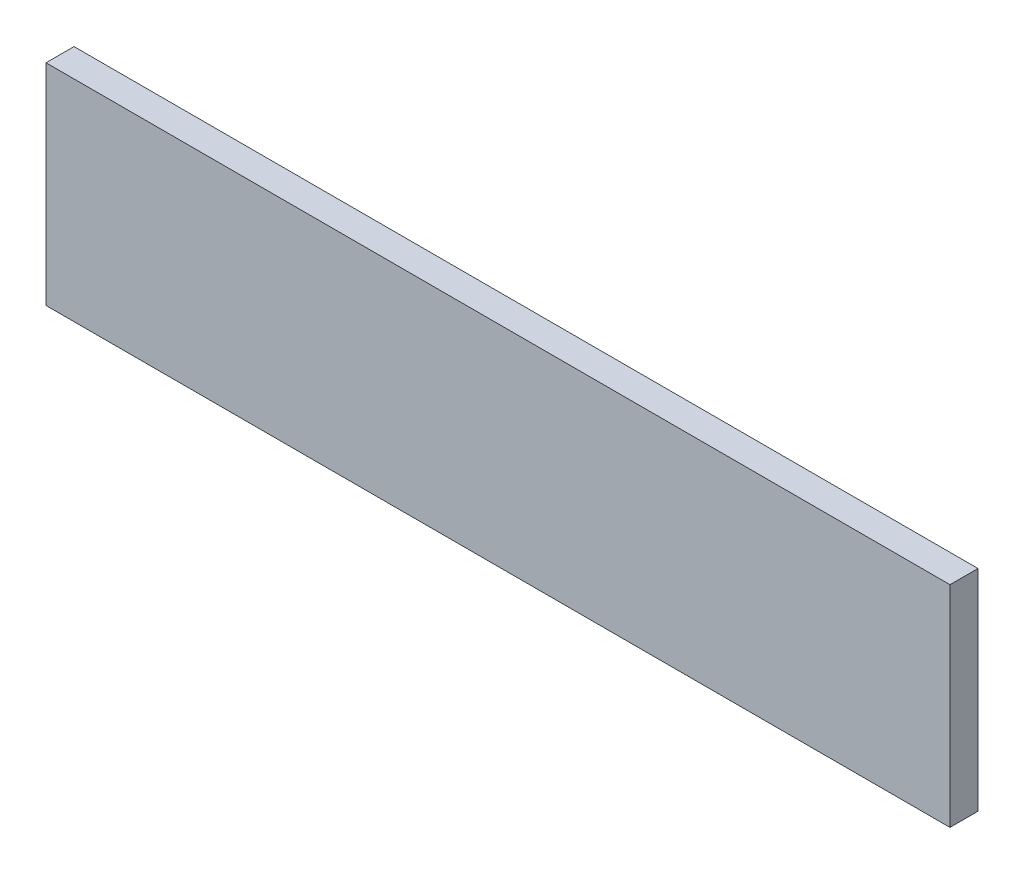
ISO-10303-21;
HEADER;
FILE_DESCRIPTION(('STEP AP214'),'2;1');
FILE_NAME('part.step','',(''),(''),'','','');
FILE_SCHEMA(('AUTOMOTIVE_DESIGN { 1 0 10303 214 1 1 1 1 }'));
ENDSEC;
DATA;
#1=APPLICATION_CONTEXT('core data for automotive mechanical design processes');
#2=APPLICATION_PROTOCOL_DEFINITION('international standard','automotive_design',2000,#1);
#3=PRODUCT_CONTEXT('',#1,'mechanical');
#4=PRODUCT('Part','Part','',(#3));
#5=PRODUCT_RELATED_PRODUCT_CATEGORY('part','',(#4));
#6=PRODUCT_DEFINITION_FORMATION('','',#4);
#7=PRODUCT_DEFINITION_CONTEXT('part definition',#1,'design');
#8=PRODUCT_DEFINITION('design','',#6,#7);
#9=PRODUCT_DEFINITION_SHAPE('','',#8);
#10=(LENGTH_UNIT() NAMED_UNIT(*) SI_UNIT(.MILLI.,.METRE.));
#11=(NAMED_UNIT(*) PLANE_ANGLE_UNIT() SI_UNIT($,.RADIAN.));
#12=(NAMED_UNIT(*) SI_UNIT($,.STERADIAN.) SOLID_ANGLE_UNIT());
#13=UNCERTAINTY_MEASURE_WITH_UNIT(LENGTH_MEASURE(1.E-05),#10,'distance_accuracy_value','');
#14=(GEOMETRIC_REPRESENTATION_CONTEXT(3) GLOBAL_UNCERTAINTY_ASSIGNED_CONTEXT((#13)) GLOBAL_UNIT_ASSIGNED_CONTEXT((#10,
#11,#12)) REPRESENTATION_CONTEXT('',''));
#15=CARTESIAN_POINT('',(0.,0.,0.));
#16=DIRECTION('',(0.,0.,1.));
#17=DIRECTION('',(1.,0.,0.));
#18=AXIS2_PLACEMENT_3D('',#15,#16,#17);
#19=CARTESIAN_POINT('',(-417.396530779445,139.479405034325,20.));
#20=DIRECTION('',(1.,0.,0.));
#21=DIRECTION('',(0.,0.,-1.));
#22=AXIS2_PLACEMENT_3D('',#19,#20,#21);
#23=PLANE('',#22);
#24=DIRECTION('',(0.,-1.,0.));
#25=VECTOR('',#24,1.);
#26=CARTESIAN_POINT('',(-417.396530779445,139.479405034325,0.));
#27=LINE('',#26,#25);
#28=CARTESIAN_POINT('',(-417.396530779445,139.479405034325,0.));
#29=VERTEX_POINT('',#28);
#30=CARTESIAN_POINT('',(-417.396530779445,-10.520594965675,0.));
#31=VERTEX_POINT('',#30);
#32=EDGE_CURVE('E96',#29,#31,#27,.T.);
#33=ORIENTED_EDGE('',*,*,#32,.T.);
#34=DIRECTION('',(0.,0.,-1.));
#35=VECTOR('',#34,1.);
#36=CARTESIAN_POINT('',(-417.396530779445,-10.520594965675,20.));
#37=LINE('',#36,#35);
#38=CARTESIAN_POINT('',(-417.396530779445,-10.520594965675,20.));
#39=VERTEX_POINT('',#38);
#40=EDGE_CURVE('E11',#39,#31,#37,.T.);
#41=ORIENTED_EDGE('',*,*,#40,.F.);
#42=DIRECTION('',(0.,-1.,0.));
#43=VECTOR('',#42,1.);
#44=CARTESIAN_POINT('',(-417.396530779445,139.479405034325,20.));
#45=LINE('',#44,#43);
#46=CARTESIAN_POINT('',(-417.396530779445,139.479405034325,20.));
#47=VERTEX_POINT('',#46);
#48=EDGE_CURVE('E84',#47,#39,#45,.T.);
#49=ORIENTED_EDGE('',*,*,#48,.F.);
#50=DIRECTION('',(0.,0.,-1.));
#51=VECTOR('',#50,1.);
#52=CARTESIAN_POINT('',(-417.396530779445,139.479405034325,20.));
#53=LINE('',#52,#51);
#54=EDGE_CURVE('E92',#47,#29,#53,.T.);
#55=ORIENTED_EDGE('',*,*,#54,.T.);
#56=EDGE_LOOP('',(#33,#41,#49,#55));
#57=FACE_BOUND('',#56,.T.);
#58=ADVANCED_FACE('F33',(#57),#23,.F.);
#59=CARTESIAN_POINT('',(-417.396530779445,-10.520594965675,20.));
#60=DIRECTION('',(0.,1.,0.));
#61=DIRECTION('',(0.,0.,1.));
#62=AXIS2_PLACEMENT_3D('',#59,#60,#61);
#63=PLANE('',#62);
#64=DIRECTION('',(1.,0.,0.));
#65=VECTOR('',#64,1.);
#66=CARTESIAN_POINT('',(-417.396530779445,-10.520594965675,0.));
#67=LINE('',#66,#65);
#68=CARTESIAN_POINT('',(227.603469220555,-10.520594965675,0.));
#69=VERTEX_POINT('',#68);
#70=EDGE_CURVE('E88',#31,#69,#67,.T.);
#71=ORIENTED_EDGE('',*,*,#70,.T.);
#72=DIRECTION('',(0.,0.,-1.));
#73=VECTOR('',#72,1.);
#74=CARTESIAN_POINT('',(227.603469220555,-10.520594965675,20.));
#75=LINE('',#74,#73);
#76=CARTESIAN_POINT('',(227.603469220555,-10.520594965675,20.));
#77=VERTEX_POINT('',#76);
#78=EDGE_CURVE('E41',#77,#69,#75,.T.);
#79=ORIENTED_EDGE('',*,*,#78,.F.);
#80=DIRECTION('',(1.,0.,0.));
#81=VECTOR('',#80,1.);
#82=CARTESIAN_POINT('',(-417.396530779445,-10.520594965675,20.));
#83=LINE('',#82,#81);
#84=EDGE_CURVE('E79',#39,#77,#83,.T.);
#85=ORIENTED_EDGE('',*,*,#84,.F.);
#86=ORIENTED_EDGE('',*,*,#40,.T.);
#87=EDGE_LOOP('',(#71,#79,#85,#86));
#88=FACE_BOUND('',#87,.T.);
#89=ADVANCED_FACE('F87',(#88),#63,.F.);
#90=CARTESIAN_POINT('',(227.603469220555,139.479405034325,20.));
#91=DIRECTION('',(-1.,0.,0.));
#92=DIRECTION('',(0.,0.,1.));
#93=AXIS2_PLACEMENT_3D('',#90,#91,#92);
#94=PLANE('',#93);
#95=DIRECTION('',(0.,1.,0.));
#96=VECTOR('',#95,1.);
#97=CARTESIAN_POINT('',(227.603469220555,139.479405034325,0.));
#98=LINE('',#97,#96);
#99=CARTESIAN_POINT('',(227.603469220555,139.479405034325,0.));
#100=VERTEX_POINT('',#99);
#101=EDGE_CURVE('E66',#69,#100,#98,.T.);
#102=ORIENTED_EDGE('',*,*,#101,.T.);
#103=DIRECTION('',(0.,0.,-1.));
#104=VECTOR('',#103,1.);
#105=CARTESIAN_POINT('',(227.603469220555,139.479405034325,20.));
#106=LINE('',#105,#104);
#107=CARTESIAN_POINT('',(227.603469220555,139.479405034325,20.));
#108=VERTEX_POINT('',#107);
#109=EDGE_CURVE('E89',#108,#100,#106,.T.);
#110=ORIENTED_EDGE('',*,*,#109,.F.);
#111=DIRECTION('',(0.,1.,0.));
#112=VECTOR('',#111,1.);
#113=CARTESIAN_POINT('',(227.603469220555,139.479405034325,20.));
#114=LINE('',#113,#112);
#115=EDGE_CURVE('E82',#77,#108,#114,.T.);
#116=ORIENTED_EDGE('',*,*,#115,.F.);
#117=ORIENTED_EDGE('',*,*,#78,.T.);
#118=EDGE_LOOP('',(#102,#110,#116,#117));
#119=FACE_BOUND('',#118,.T.);
#120=ADVANCED_FACE('F90',(#119),#94,.F.);
#121=CARTESIAN_POINT('',(-417.396530779445,139.479405034325,20.));
#122=DIRECTION('',(0.,-1.,0.));
#123=DIRECTION('',(0.,0.,-1.));
#124=AXIS2_PLACEMENT_3D('',#121,#122,#123);
#125=PLANE('',#124);
#126=DIRECTION('',(-1.,0.,0.));
#127=VECTOR('',#126,1.);
#128=CARTESIAN_POINT('',(-417.396530779445,139.479405034325,0.));
#129=LINE('',#128,#127);
#130=EDGE_CURVE('E72',#100,#29,#129,.T.);
#131=ORIENTED_EDGE('',*,*,#130,.T.);
#132=ORIENTED_EDGE('',*,*,#54,.F.);
#133=DIRECTION('',(-1.,0.,0.));
#134=VECTOR('',#133,1.);
#135=CARTESIAN_POINT('',(-417.396530779445,139.479405034325,20.));
#136=LINE('',#135,#134);
#137=EDGE_CURVE('E49',#108,#47,#136,.T.);
#138=ORIENTED_EDGE('',*,*,#137,.F.);
#139=ORIENTED_EDGE('',*,*,#109,.T.);
#140=EDGE_LOOP('',(#131,#132,#138,#139));
#141=FACE_BOUND('',#140,.T.);
#142=ADVANCED_FACE('F103',(#141),#125,.F.);
#143=CARTESIAN_POINT('',(0.,0.,20.));
#144=DIRECTION('',(0.,0.,1.));
#145=DIRECTION('',(1.,0.,0.));
#146=AXIS2_PLACEMENT_3D('',#143,#144,#145);
#147=PLANE('',#146);
#148=ORIENTED_EDGE('',*,*,#48,.T.);
#149=ORIENTED_EDGE('',*,*,#84,.T.);
#150=ORIENTED_EDGE('',*,*,#115,.T.);
#151=ORIENTED_EDGE('',*,*,#137,.T.);
#152=EDGE_LOOP('',(#148,#149,#150,#151));
#153=FACE_BOUND('',#152,.T.);
#154=ADVANCED_FACE('F80',(#153),#147,.T.);
#155=CARTESIAN_POINT('',(0.,0.,0.));
#156=DIRECTION('',(0.,0.,1.));
#157=DIRECTION('',(1.,0.,0.));
#158=AXIS2_PLACEMENT_3D('',#155,#156,#157);
#159=PLANE('',#158);
#160=ORIENTED_EDGE('',*,*,#32,.F.);
#161=ORIENTED_EDGE('',*,*,#130,.F.);
#162=ORIENTED_EDGE('',*,*,#101,.F.);
#163=ORIENTED_EDGE('',*,*,#70,.F.);
#164=EDGE_LOOP('',(#160,#161,#162,#163));
#165=FACE_BOUND('',#164,.T.);
#166=ADVANCED_FACE('F106',(#165),#159,.F.);
#167=CLOSED_SHELL('',(#58,#89,#120,#142,#154,#166));
#168=MANIFOLD_SOLID_BREP('B2',#167);
#169=ADVANCED_BREP_SHAPE_REPRESENTATION('',(#18,#168),#14);
#170=SHAPE_DEFINITION_REPRESENTATION(#9,#169);
ENDSEC;
END-ISO-10303-21;
